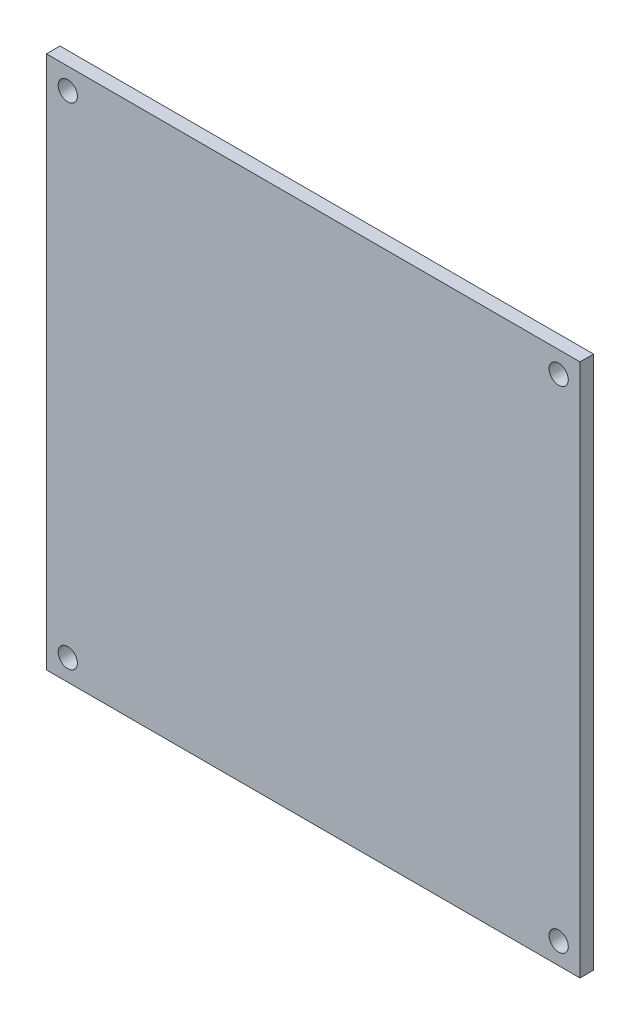
ISO-10303-21;
HEADER;
FILE_DESCRIPTION(('STEP AP214'),'2;1');
FILE_NAME('part.step','',(''),(''),'','','');
FILE_SCHEMA(('AUTOMOTIVE_DESIGN { 1 0 10303 214 1 1 1 1 }'));
ENDSEC;
DATA;
#1=APPLICATION_CONTEXT('core data for automotive mechanical design processes');
#2=APPLICATION_PROTOCOL_DEFINITION('international standard','automotive_design',2000,#1);
#3=PRODUCT_CONTEXT('',#1,'mechanical');
#4=PRODUCT('Part','Part','',(#3));
#5=PRODUCT_RELATED_PRODUCT_CATEGORY('part','',(#4));
#6=PRODUCT_DEFINITION_FORMATION('','',#4);
#7=PRODUCT_DEFINITION_CONTEXT('part definition',#1,'design');
#8=PRODUCT_DEFINITION('design','',#6,#7);
#9=PRODUCT_DEFINITION_SHAPE('','',#8);
#10=(LENGTH_UNIT() NAMED_UNIT(*) SI_UNIT(.MILLI.,.METRE.));
#11=(NAMED_UNIT(*) PLANE_ANGLE_UNIT() SI_UNIT($,.RADIAN.));
#12=(NAMED_UNIT(*) SI_UNIT($,.STERADIAN.) SOLID_ANGLE_UNIT());
#13=UNCERTAINTY_MEASURE_WITH_UNIT(LENGTH_MEASURE(1.E-05),#10,'distance_accuracy_value','');
#14=(GEOMETRIC_REPRESENTATION_CONTEXT(3) GLOBAL_UNCERTAINTY_ASSIGNED_CONTEXT((#13)) GLOBAL_UNIT_ASSIGNED_CONTEXT((#10,
#11,#12)) REPRESENTATION_CONTEXT('',''));
#15=CARTESIAN_POINT('',(0.,0.,0.));
#16=DIRECTION('',(0.,0.,1.));
#17=DIRECTION('',(1.,0.,0.));
#18=AXIS2_PLACEMENT_3D('',#15,#16,#17);
#19=CARTESIAN_POINT('',(-62.5,-62.5,3.175));
#20=DIRECTION('',(1.,0.,0.));
#21=DIRECTION('',(0.,1.,0.));
#22=AXIS2_PLACEMENT_3D('',#19,#20,#21);
#23=PLANE('',#22);
#24=DIRECTION('',(0.,-1.,0.));
#25=VECTOR('',#24,1.);
#26=CARTESIAN_POINT('',(-62.5,-62.5,0.));
#27=LINE('',#26,#25);
#28=CARTESIAN_POINT('',(-62.5,62.5,0.));
#29=VERTEX_POINT('',#28);
#30=CARTESIAN_POINT('',(-62.5,-62.5,0.));
#31=VERTEX_POINT('',#30);
#32=EDGE_CURVE('E100',#29,#31,#27,.T.);
#33=ORIENTED_EDGE('',*,*,#32,.T.);
#34=DIRECTION('',(0.,0.,-1.));
#35=VECTOR('',#34,1.);
#36=CARTESIAN_POINT('',(-62.5,-62.5,3.175));
#37=LINE('',#36,#35);
#38=CARTESIAN_POINT('',(-62.5,-62.5,3.175));
#39=VERTEX_POINT('',#38);
#40=EDGE_CURVE('E11',#39,#31,#37,.T.);
#41=ORIENTED_EDGE('',*,*,#40,.F.);
#42=DIRECTION('',(0.,-1.,0.));
#43=VECTOR('',#42,1.);
#44=CARTESIAN_POINT('',(-62.5,-62.5,3.175));
#45=LINE('',#44,#43);
#46=CARTESIAN_POINT('',(-62.5,62.5,3.175));
#47=VERTEX_POINT('',#46);
#48=EDGE_CURVE('E88',#47,#39,#45,.T.);
#49=ORIENTED_EDGE('',*,*,#48,.F.);
#50=DIRECTION('',(0.,0.,-1.));
#51=VECTOR('',#50,1.);
#52=CARTESIAN_POINT('',(-62.5,62.5,3.175));
#53=LINE('',#52,#51);
#54=EDGE_CURVE('E96',#47,#29,#53,.T.);
#55=ORIENTED_EDGE('',*,*,#54,.T.);
#56=EDGE_LOOP('',(#33,#41,#49,#55));
#57=FACE_BOUND('',#56,.T.);
#58=ADVANCED_FACE('F37',(#57),#23,.F.);
#59=CARTESIAN_POINT('',(62.5,-62.5,3.175));
#60=DIRECTION('',(0.,1.,0.));
#61=DIRECTION('',(-1.,0.,0.));
#62=AXIS2_PLACEMENT_3D('',#59,#60,#61);
#63=PLANE('',#62);
#64=DIRECTION('',(1.,0.,0.));
#65=VECTOR('',#64,1.);
#66=CARTESIAN_POINT('',(62.5,-62.5,0.));
#67=LINE('',#66,#65);
#68=CARTESIAN_POINT('',(62.5,-62.5,0.));
#69=VERTEX_POINT('',#68);
#70=EDGE_CURVE('E92',#31,#69,#67,.T.);
#71=ORIENTED_EDGE('',*,*,#70,.T.);
#72=DIRECTION('',(0.,0.,-1.));
#73=VECTOR('',#72,1.);
#74=CARTESIAN_POINT('',(62.5,-62.5,3.175));
#75=LINE('',#74,#73);
#76=CARTESIAN_POINT('',(62.5,-62.5,3.175));
#77=VERTEX_POINT('',#76);
#78=EDGE_CURVE('E45',#77,#69,#75,.T.);
#79=ORIENTED_EDGE('',*,*,#78,.F.);
#80=DIRECTION('',(1.,0.,0.));
#81=VECTOR('',#80,1.);
#82=CARTESIAN_POINT('',(62.5,-62.5,3.175));
#83=LINE('',#82,#81);
#84=EDGE_CURVE('E83',#39,#77,#83,.T.);
#85=ORIENTED_EDGE('',*,*,#84,.F.);
#86=ORIENTED_EDGE('',*,*,#40,.T.);
#87=EDGE_LOOP('',(#71,#79,#85,#86));
#88=FACE_BOUND('',#87,.T.);
#89=ADVANCED_FACE('F91',(#88),#63,.F.);
#90=CARTESIAN_POINT('',(62.5,-62.5,3.175));
#91=DIRECTION('',(-1.,0.,0.));
#92=DIRECTION('',(0.,0.,1.));
#93=AXIS2_PLACEMENT_3D('',#90,#91,#92);
#94=PLANE('',#93);
#95=DIRECTION('',(0.,1.,0.));
#96=VECTOR('',#95,1.);
#97=CARTESIAN_POINT('',(62.5,-62.5,0.));
#98=LINE('',#97,#96);
#99=CARTESIAN_POINT('',(62.5,62.5,0.));
#100=VERTEX_POINT('',#99);
#101=EDGE_CURVE('E70',#69,#100,#98,.T.);
#102=ORIENTED_EDGE('',*,*,#101,.T.);
#103=DIRECTION('',(0.,0.,-1.));
#104=VECTOR('',#103,1.);
#105=CARTESIAN_POINT('',(62.5,62.5,3.175));
#106=LINE('',#105,#104);
#107=CARTESIAN_POINT('',(62.5,62.5,3.175));
#108=VERTEX_POINT('',#107);
#109=EDGE_CURVE('E93',#108,#100,#106,.T.);
#110=ORIENTED_EDGE('',*,*,#109,.F.);
#111=DIRECTION('',(0.,1.,0.));
#112=VECTOR('',#111,1.);
#113=CARTESIAN_POINT('',(62.5,-62.5,3.175));
#114=LINE('',#113,#112);
#115=EDGE_CURVE('E86',#77,#108,#114,.T.);
#116=ORIENTED_EDGE('',*,*,#115,.F.);
#117=ORIENTED_EDGE('',*,*,#78,.T.);
#118=EDGE_LOOP('',(#102,#110,#116,#117));
#119=FACE_BOUND('',#118,.T.);
#120=ADVANCED_FACE('F94',(#119),#94,.F.);
#121=CARTESIAN_POINT('',(62.5,62.5,3.175));
#122=DIRECTION('',(0.,-1.,0.));
#123=DIRECTION('',(1.,0.,0.));
#124=AXIS2_PLACEMENT_3D('',#121,#122,#123);
#125=PLANE('',#124);
#126=DIRECTION('',(-1.,0.,0.));
#127=VECTOR('',#126,1.);
#128=CARTESIAN_POINT('',(62.5,62.5,0.));
#129=LINE('',#128,#127);
#130=EDGE_CURVE('E76',#100,#29,#129,.T.);
#131=ORIENTED_EDGE('',*,*,#130,.T.);
#132=ORIENTED_EDGE('',*,*,#54,.F.);
#133=DIRECTION('',(-1.,0.,0.));
#134=VECTOR('',#133,1.);
#135=CARTESIAN_POINT('',(62.5,62.5,3.175));
#136=LINE('',#135,#134);
#137=EDGE_CURVE('E53',#108,#47,#136,.T.);
#138=ORIENTED_EDGE('',*,*,#137,.F.);
#139=ORIENTED_EDGE('',*,*,#109,.T.);
#140=EDGE_LOOP('',(#131,#132,#138,#139));
#141=FACE_BOUND('',#140,.T.);
#142=ADVANCED_FACE('F108',(#141),#125,.F.);
#143=CARTESIAN_POINT('',(0.,0.,3.175));
#144=DIRECTION('',(0.,0.,1.));
#145=DIRECTION('',(1.,0.,0.));
#146=AXIS2_PLACEMENT_3D('',#143,#144,#145);
#147=PLANE('',#146);
#148=CARTESIAN_POINT('',(57.5,57.5,3.175));
#149=DIRECTION('',(0.,0.,1.));
#150=DIRECTION('',(-1.,0.,0.));
#151=AXIS2_PLACEMENT_3D('',#148,#149,#150);
#152=CIRCLE('',#151,2.25);
#153=CARTESIAN_POINT('',(55.25,57.5,3.175));
#154=VERTEX_POINT('',#153);
#155=EDGE_CURVE('E120',#154,#154,#152,.T.);
#156=ORIENTED_EDGE('',*,*,#155,.F.);
#157=EDGE_LOOP('',(#156));
#158=FACE_BOUND('',#157,.T.);
#159=CARTESIAN_POINT('',(57.5,-57.5,3.175));
#160=DIRECTION('',(0.,0.,1.));
#161=DIRECTION('',(-1.,0.,0.));
#162=AXIS2_PLACEMENT_3D('',#159,#160,#161);
#163=CIRCLE('',#162,2.25);
#164=CARTESIAN_POINT('',(55.25,-57.5,3.175));
#165=VERTEX_POINT('',#164);
#166=EDGE_CURVE('E126',#165,#165,#163,.T.);
#167=ORIENTED_EDGE('',*,*,#166,.F.);
#168=EDGE_LOOP('',(#167));
#169=FACE_BOUND('',#168,.T.);
#170=CARTESIAN_POINT('',(-57.5,-57.5,3.175));
#171=DIRECTION('',(0.,0.,1.));
#172=DIRECTION('',(1.,0.,0.));
#173=AXIS2_PLACEMENT_3D('',#170,#171,#172);
#174=CIRCLE('',#173,2.25);
#175=CARTESIAN_POINT('',(-55.25,-57.5,3.175));
#176=VERTEX_POINT('',#175);
#177=EDGE_CURVE('E132',#176,#176,#174,.T.);
#178=ORIENTED_EDGE('',*,*,#177,.F.);
#179=EDGE_LOOP('',(#178));
#180=FACE_BOUND('',#179,.T.);
#181=CARTESIAN_POINT('',(-57.5,57.5,3.175));
#182=DIRECTION('',(0.,0.,1.));
#183=DIRECTION('',(1.,0.,0.));
#184=AXIS2_PLACEMENT_3D('',#181,#182,#183);
#185=CIRCLE('',#184,2.25);
#186=CARTESIAN_POINT('',(-55.25,57.5,3.175));
#187=VERTEX_POINT('',#186);
#188=EDGE_CURVE('E114',#187,#187,#185,.T.);
#189=ORIENTED_EDGE('',*,*,#188,.F.);
#190=EDGE_LOOP('',(#189));
#191=FACE_BOUND('',#190,.T.);
#192=ORIENTED_EDGE('',*,*,#48,.T.);
#193=ORIENTED_EDGE('',*,*,#84,.T.);
#194=ORIENTED_EDGE('',*,*,#115,.T.);
#195=ORIENTED_EDGE('',*,*,#137,.T.);
#196=EDGE_LOOP('',(#192,#193,#194,#195));
#197=FACE_BOUND('',#196,.T.);
#198=ADVANCED_FACE('F84',(#158,#169,#180,#191,#197),#147,.T.);
#199=CARTESIAN_POINT('',(0.,0.,0.));
#200=DIRECTION('',(0.,0.,1.));
#201=DIRECTION('',(1.,0.,0.));
#202=AXIS2_PLACEMENT_3D('',#199,#200,#201);
#203=PLANE('',#202);
#204=CARTESIAN_POINT('',(57.5,57.5,0.));
#205=DIRECTION('',(0.,0.,1.));
#206=DIRECTION('',(-1.,0.,0.));
#207=AXIS2_PLACEMENT_3D('',#204,#205,#206);
#208=CIRCLE('',#207,2.25);
#209=CARTESIAN_POINT('',(55.25,57.5,0.));
#210=VERTEX_POINT('',#209);
#211=EDGE_CURVE('E123',#210,#210,#208,.T.);
#212=ORIENTED_EDGE('',*,*,#211,.T.);
#213=EDGE_LOOP('',(#212));
#214=FACE_BOUND('',#213,.T.);
#215=CARTESIAN_POINT('',(57.5,-57.5,0.));
#216=DIRECTION('',(0.,0.,1.));
#217=DIRECTION('',(-1.,0.,0.));
#218=AXIS2_PLACEMENT_3D('',#215,#216,#217);
#219=CIRCLE('',#218,2.25);
#220=CARTESIAN_POINT('',(55.25,-57.5,0.));
#221=VERTEX_POINT('',#220);
#222=EDGE_CURVE('E129',#221,#221,#219,.T.);
#223=ORIENTED_EDGE('',*,*,#222,.T.);
#224=EDGE_LOOP('',(#223));
#225=FACE_BOUND('',#224,.T.);
#226=CARTESIAN_POINT('',(-57.5,-57.5,0.));
#227=DIRECTION('',(0.,0.,1.));
#228=DIRECTION('',(1.,0.,0.));
#229=AXIS2_PLACEMENT_3D('',#226,#227,#228);
#230=CIRCLE('',#229,2.25);
#231=CARTESIAN_POINT('',(-55.25,-57.5,0.));
#232=VERTEX_POINT('',#231);
#233=EDGE_CURVE('E117',#232,#232,#230,.T.);
#234=ORIENTED_EDGE('',*,*,#233,.T.);
#235=EDGE_LOOP('',(#234));
#236=FACE_BOUND('',#235,.T.);
#237=CARTESIAN_POINT('',(-57.5,57.5,0.));
#238=DIRECTION('',(0.,0.,1.));
#239=DIRECTION('',(1.,0.,0.));
#240=AXIS2_PLACEMENT_3D('',#237,#238,#239);
#241=CIRCLE('',#240,2.25);
#242=CARTESIAN_POINT('',(-55.25,57.5,0.));
#243=VERTEX_POINT('',#242);
#244=EDGE_CURVE('E103',#243,#243,#241,.T.);
#245=ORIENTED_EDGE('',*,*,#244,.T.);
#246=EDGE_LOOP('',(#245));
#247=FACE_BOUND('',#246,.T.);
#248=ORIENTED_EDGE('',*,*,#32,.F.);
#249=ORIENTED_EDGE('',*,*,#130,.F.);
#250=ORIENTED_EDGE('',*,*,#101,.F.);
#251=ORIENTED_EDGE('',*,*,#70,.F.);
#252=EDGE_LOOP('',(#248,#249,#250,#251));
#253=FACE_BOUND('',#252,.T.);
#254=ADVANCED_FACE('F111',(#214,#225,#236,#247,#253),#203,.F.);
#255=CARTESIAN_POINT('',(-57.5,57.5,0.));
#256=DIRECTION('',(0.,0.,1.));
#257=DIRECTION('',(1.,0.,0.));
#258=AXIS2_PLACEMENT_3D('',#255,#256,#257);
#259=CYLINDRICAL_SURFACE('',#258,2.25);
#260=ORIENTED_EDGE('',*,*,#244,.F.);
#261=EDGE_LOOP('',(#260));
#262=FACE_BOUND('',#261,.T.);
#263=ORIENTED_EDGE('',*,*,#188,.T.);
#264=EDGE_LOOP('',(#263));
#265=FACE_BOUND('',#264,.T.);
#266=ADVANCED_FACE('F144',(#262,#265),#259,.F.);
#267=CARTESIAN_POINT('',(-57.5,-57.5,0.));
#268=DIRECTION('',(0.,0.,1.));
#269=DIRECTION('',(1.,0.,0.));
#270=AXIS2_PLACEMENT_3D('',#267,#268,#269);
#271=CYLINDRICAL_SURFACE('',#270,2.25);
#272=ORIENTED_EDGE('',*,*,#233,.F.);
#273=EDGE_LOOP('',(#272));
#274=FACE_BOUND('',#273,.T.);
#275=ORIENTED_EDGE('',*,*,#177,.T.);
#276=EDGE_LOOP('',(#275));
#277=FACE_BOUND('',#276,.T.);
#278=ADVANCED_FACE('F140',(#274,#277),#271,.F.);
#279=CARTESIAN_POINT('',(57.5,-57.5,0.));
#280=DIRECTION('',(0.,0.,1.));
#281=DIRECTION('',(1.,0.,0.));
#282=AXIS2_PLACEMENT_3D('',#279,#280,#281);
#283=CYLINDRICAL_SURFACE('',#282,2.25);
#284=ORIENTED_EDGE('',*,*,#222,.F.);
#285=EDGE_LOOP('',(#284));
#286=FACE_BOUND('',#285,.T.);
#287=ORIENTED_EDGE('',*,*,#166,.T.);
#288=EDGE_LOOP('',(#287));
#289=FACE_BOUND('',#288,.T.);
#290=ADVANCED_FACE('F143',(#286,#289),#283,.F.);
#291=CARTESIAN_POINT('',(57.5,57.5,0.));
#292=DIRECTION('',(0.,0.,1.));
#293=DIRECTION('',(1.,0.,0.));
#294=AXIS2_PLACEMENT_3D('',#291,#292,#293);
#295=CYLINDRICAL_SURFACE('',#294,2.25);
#296=ORIENTED_EDGE('',*,*,#211,.F.);
#297=EDGE_LOOP('',(#296));
#298=FACE_BOUND('',#297,.T.);
#299=ORIENTED_EDGE('',*,*,#155,.T.);
#300=EDGE_LOOP('',(#299));
#301=FACE_BOUND('',#300,.T.);
#302=ADVANCED_FACE('F205',(#298,#301),#295,.F.);
#303=CLOSED_SHELL('',(#58,#89,#120,#142,#198,#254,#266,#278,#290,#302));
#304=MANIFOLD_SOLID_BREP('B2',#303);
#305=ADVANCED_BREP_SHAPE_REPRESENTATION('',(#18,#304),#14);
#306=SHAPE_DEFINITION_REPRESENTATION(#9,#305);
ENDSEC;
END-ISO-10303-21;
